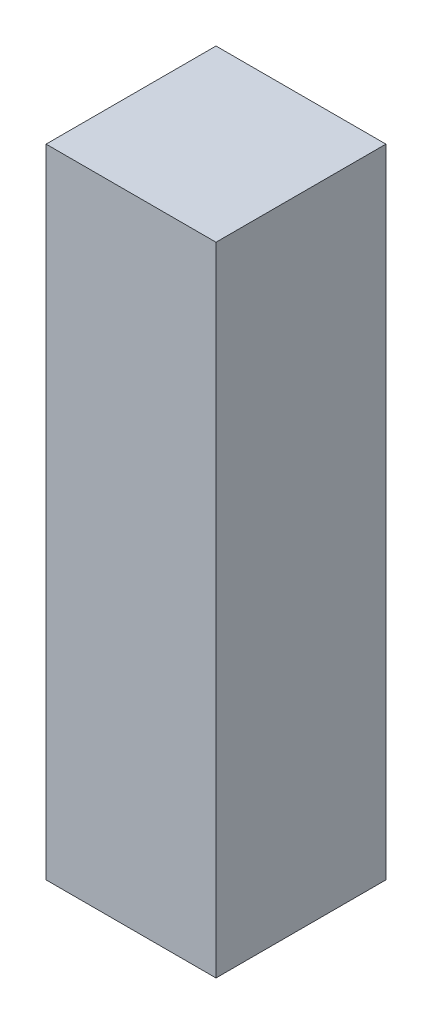
ISO-10303-21;
HEADER;
FILE_DESCRIPTION(('STEP AP214'),'2;1');
FILE_NAME('part.step','',(''),(''),'','','');
FILE_SCHEMA(('AUTOMOTIVE_DESIGN { 1 0 10303 214 1 1 1 1 }'));
ENDSEC;
DATA;
#1=APPLICATION_CONTEXT('core data for automotive mechanical design processes');
#2=APPLICATION_PROTOCOL_DEFINITION('international standard','automotive_design',2000,#1);
#3=PRODUCT_CONTEXT('',#1,'mechanical');
#4=PRODUCT('Part','Part','',(#3));
#5=PRODUCT_RELATED_PRODUCT_CATEGORY('part','',(#4));
#6=PRODUCT_DEFINITION_FORMATION('','',#4);
#7=PRODUCT_DEFINITION_CONTEXT('part definition',#1,'design');
#8=PRODUCT_DEFINITION('design','',#6,#7);
#9=PRODUCT_DEFINITION_SHAPE('','',#8);
#10=(LENGTH_UNIT() NAMED_UNIT(*) SI_UNIT(.MILLI.,.METRE.));
#11=(NAMED_UNIT(*) PLANE_ANGLE_UNIT() SI_UNIT($,.RADIAN.));
#12=(NAMED_UNIT(*) SI_UNIT($,.STERADIAN.) SOLID_ANGLE_UNIT());
#13=UNCERTAINTY_MEASURE_WITH_UNIT(LENGTH_MEASURE(1.E-05),#10,'distance_accuracy_value','');
#14=(GEOMETRIC_REPRESENTATION_CONTEXT(3) GLOBAL_UNCERTAINTY_ASSIGNED_CONTEXT((#13)) GLOBAL_UNIT_ASSIGNED_CONTEXT((#10,
#11,#12)) REPRESENTATION_CONTEXT('',''));
#15=CARTESIAN_POINT('',(0.,0.,0.));
#16=DIRECTION('',(0.,0.,1.));
#17=DIRECTION('',(1.,0.,0.));
#18=AXIS2_PLACEMENT_3D('',#15,#16,#17);
#19=CARTESIAN_POINT('',(0.,3.,-0.8));
#20=DIRECTION('',(1.,0.,0.));
#21=DIRECTION('',(0.,0.,-1.));
#22=AXIS2_PLACEMENT_3D('',#19,#20,#21);
#23=PLANE('',#22);
#24=DIRECTION('',(0.,0.,1.));
#25=VECTOR('',#24,1.);
#26=CARTESIAN_POINT('',(0.,0.,-0.8));
#27=LINE('',#26,#25);
#28=CARTESIAN_POINT('',(0.,0.,-0.8));
#29=VERTEX_POINT('',#28);
#30=CARTESIAN_POINT('',(0.,0.,0.));
#31=VERTEX_POINT('',#30);
#32=EDGE_CURVE('E111',#29,#31,#27,.T.);
#33=ORIENTED_EDGE('',*,*,#32,.T.);
#34=DIRECTION('',(0.,-1.,0.));
#35=VECTOR('',#34,1.);
#36=CARTESIAN_POINT('',(0.,3.,0.));
#37=LINE('',#36,#35);
#38=CARTESIAN_POINT('',(0.,3.,0.));
#39=VERTEX_POINT('',#38);
#40=EDGE_CURVE('E11',#39,#31,#37,.T.);
#41=ORIENTED_EDGE('',*,*,#40,.F.);
#42=DIRECTION('',(0.,0.,1.));
#43=VECTOR('',#42,1.);
#44=CARTESIAN_POINT('',(0.,3.,-0.8));
#45=LINE('',#44,#43);
#46=CARTESIAN_POINT('',(0.,3.,-0.8));
#47=VERTEX_POINT('',#46);
#48=EDGE_CURVE('E95',#47,#39,#45,.T.);
#49=ORIENTED_EDGE('',*,*,#48,.F.);
#50=DIRECTION('',(0.,-1.,0.));
#51=VECTOR('',#50,1.);
#52=CARTESIAN_POINT('',(0.,3.,-0.8));
#53=LINE('',#52,#51);
#54=EDGE_CURVE('E107',#47,#29,#53,.T.);
#55=ORIENTED_EDGE('',*,*,#54,.T.);
#56=EDGE_LOOP('',(#33,#41,#49,#55));
#57=FACE_BOUND('',#56,.T.);
#58=ADVANCED_FACE('F43',(#57),#23,.F.);
#59=CARTESIAN_POINT('',(0.,3.,0.));
#60=DIRECTION('',(0.,0.,-1.));
#61=DIRECTION('',(-1.,0.,0.));
#62=AXIS2_PLACEMENT_3D('',#59,#60,#61);
#63=PLANE('',#62);
#64=DIRECTION('',(1.,0.,0.));
#65=VECTOR('',#64,1.);
#66=CARTESIAN_POINT('',(0.,0.,0.));
#67=LINE('',#66,#65);
#68=CARTESIAN_POINT('',(0.8,0.,0.));
#69=VERTEX_POINT('',#68);
#70=EDGE_CURVE('E100',#31,#69,#67,.T.);
#71=ORIENTED_EDGE('',*,*,#70,.T.);
#72=DIRECTION('',(0.,-1.,0.));
#73=VECTOR('',#72,1.);
#74=CARTESIAN_POINT('',(0.8,3.,0.));
#75=LINE('',#74,#73);
#76=CARTESIAN_POINT('',(0.8,3.,0.));
#77=VERTEX_POINT('',#76);
#78=EDGE_CURVE('E52',#77,#69,#75,.T.);
#79=ORIENTED_EDGE('',*,*,#78,.F.);
#80=DIRECTION('',(1.,0.,0.));
#81=VECTOR('',#80,1.);
#82=CARTESIAN_POINT('',(0.,3.,0.));
#83=LINE('',#82,#81);
#84=EDGE_CURVE('E90',#39,#77,#83,.T.);
#85=ORIENTED_EDGE('',*,*,#84,.F.);
#86=ORIENTED_EDGE('',*,*,#40,.T.);
#87=EDGE_LOOP('',(#71,#79,#85,#86));
#88=FACE_BOUND('',#87,.T.);
#89=ADVANCED_FACE('F99',(#88),#63,.F.);
#90=CARTESIAN_POINT('',(0.8,3.,-0.8));
#91=DIRECTION('',(-1.,0.,0.));
#92=DIRECTION('',(0.,0.,1.));
#93=AXIS2_PLACEMENT_3D('',#90,#91,#92);
#94=PLANE('',#93);
#95=DIRECTION('',(0.,0.,-1.));
#96=VECTOR('',#95,1.);
#97=CARTESIAN_POINT('',(0.8,0.,-0.8));
#98=LINE('',#97,#96);
#99=CARTESIAN_POINT('',(0.8,0.,-0.8));
#100=VERTEX_POINT('',#99);
#101=EDGE_CURVE('E77',#69,#100,#98,.T.);
#102=ORIENTED_EDGE('',*,*,#101,.T.);
#103=DIRECTION('',(0.,-1.,0.));
#104=VECTOR('',#103,1.);
#105=CARTESIAN_POINT('',(0.8,3.,-0.8));
#106=LINE('',#105,#104);
#107=CARTESIAN_POINT('',(0.8,3.,-0.8));
#108=VERTEX_POINT('',#107);
#109=EDGE_CURVE('E102',#108,#100,#106,.T.);
#110=ORIENTED_EDGE('',*,*,#109,.F.);
#111=DIRECTION('',(0.,0.,-1.));
#112=VECTOR('',#111,1.);
#113=CARTESIAN_POINT('',(0.8,3.,-0.8));
#114=LINE('',#113,#112);
#115=EDGE_CURVE('E93',#77,#108,#114,.T.);
#116=ORIENTED_EDGE('',*,*,#115,.F.);
#117=ORIENTED_EDGE('',*,*,#78,.T.);
#118=EDGE_LOOP('',(#102,#110,#116,#117));
#119=FACE_BOUND('',#118,.T.);
#120=ADVANCED_FACE('F103',(#119),#94,.F.);
#121=CARTESIAN_POINT('',(0.,3.,-0.8));
#122=DIRECTION('',(0.,0.,1.));
#123=DIRECTION('',(1.,0.,0.));
#124=AXIS2_PLACEMENT_3D('',#121,#122,#123);
#125=PLANE('',#124);
#126=DIRECTION('',(-1.,0.,0.));
#127=VECTOR('',#126,1.);
#128=CARTESIAN_POINT('',(0.,0.,-0.8));
#129=LINE('',#128,#127);
#130=EDGE_CURVE('E83',#100,#29,#129,.T.);
#131=ORIENTED_EDGE('',*,*,#130,.T.);
#132=ORIENTED_EDGE('',*,*,#54,.F.);
#133=DIRECTION('',(-1.,0.,0.));
#134=VECTOR('',#133,1.);
#135=CARTESIAN_POINT('',(0.,3.,-0.8));
#136=LINE('',#135,#134);
#137=EDGE_CURVE('E60',#108,#47,#136,.T.);
#138=ORIENTED_EDGE('',*,*,#137,.F.);
#139=ORIENTED_EDGE('',*,*,#109,.T.);
#140=EDGE_LOOP('',(#131,#132,#138,#139));
#141=FACE_BOUND('',#140,.T.);
#142=ADVANCED_FACE('F124',(#141),#125,.F.);
#143=CARTESIAN_POINT('',(0.,3.,0.));
#144=DIRECTION('',(0.,1.,0.));
#145=DIRECTION('',(0.,0.,1.));
#146=AXIS2_PLACEMENT_3D('',#143,#144,#145);
#147=PLANE('',#146);
#148=ORIENTED_EDGE('',*,*,#48,.T.);
#149=ORIENTED_EDGE('',*,*,#84,.T.);
#150=ORIENTED_EDGE('',*,*,#115,.T.);
#151=ORIENTED_EDGE('',*,*,#137,.T.);
#152=EDGE_LOOP('',(#148,#149,#150,#151));
#153=FACE_BOUND('',#152,.T.);
#154=ADVANCED_FACE('F91',(#153),#147,.T.);
#155=CARTESIAN_POINT('',(0.,0.,0.));
#156=DIRECTION('',(0.,1.,0.));
#157=DIRECTION('',(0.,0.,1.));
#158=AXIS2_PLACEMENT_3D('',#155,#156,#157);
#159=PLANE('',#158);
#160=ORIENTED_EDGE('',*,*,#32,.F.);
#161=ORIENTED_EDGE('',*,*,#130,.F.);
#162=ORIENTED_EDGE('',*,*,#101,.F.);
#163=ORIENTED_EDGE('',*,*,#70,.F.);
#164=EDGE_LOOP('',(#160,#161,#162,#163));
#165=FACE_BOUND('',#164,.T.);
#166=ADVANCED_FACE('F127',(#165),#159,.F.);
#167=CLOSED_SHELL('',(#58,#89,#120,#142,#154,#166));
#168=MANIFOLD_SOLID_BREP('B2',#167);
#169=ADVANCED_BREP_SHAPE_REPRESENTATION('',(#18,#168),#14);
#170=SHAPE_DEFINITION_REPRESENTATION(#9,#169);
ENDSEC;
END-ISO-10303-21;
